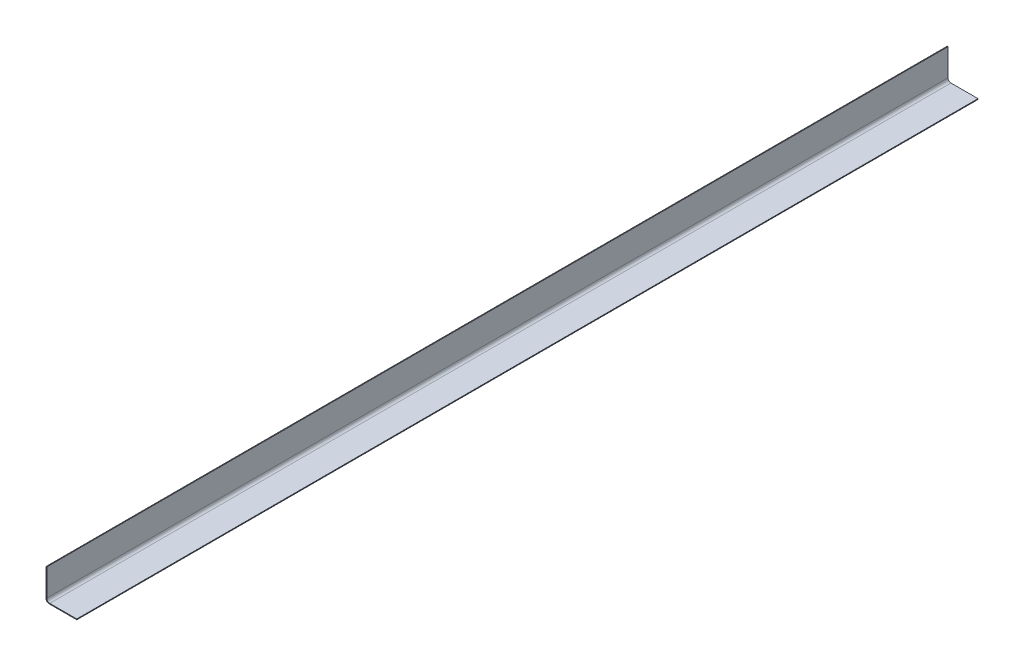
ISO-10303-21;
HEADER;
FILE_DESCRIPTION(('STEP AP214'),'2;1');
FILE_NAME('part.step','',(''),(''),'','','');
FILE_SCHEMA(('AUTOMOTIVE_DESIGN { 1 0 10303 214 1 1 1 1 }'));
ENDSEC;
DATA;
#1=APPLICATION_CONTEXT('core data for automotive mechanical design processes');
#2=APPLICATION_PROTOCOL_DEFINITION('international standard','automotive_design',2000,#1);
#3=PRODUCT_CONTEXT('',#1,'mechanical');
#4=PRODUCT('Part','Part','',(#3));
#5=PRODUCT_RELATED_PRODUCT_CATEGORY('part','',(#4));
#6=PRODUCT_DEFINITION_FORMATION('','',#4);
#7=PRODUCT_DEFINITION_CONTEXT('part definition',#1,'design');
#8=PRODUCT_DEFINITION('design','',#6,#7);
#9=PRODUCT_DEFINITION_SHAPE('','',#8);
#10=(LENGTH_UNIT() NAMED_UNIT(*) SI_UNIT(.MILLI.,.METRE.));
#11=(NAMED_UNIT(*) PLANE_ANGLE_UNIT() SI_UNIT($,.RADIAN.));
#12=(NAMED_UNIT(*) SI_UNIT($,.STERADIAN.) SOLID_ANGLE_UNIT());
#13=UNCERTAINTY_MEASURE_WITH_UNIT(LENGTH_MEASURE(1.E-05),#10,'distance_accuracy_value','');
#14=(GEOMETRIC_REPRESENTATION_CONTEXT(3) GLOBAL_UNCERTAINTY_ASSIGNED_CONTEXT((#13)) GLOBAL_UNIT_ASSIGNED_CONTEXT((#10,
#11,#12)) REPRESENTATION_CONTEXT('',''));
#15=CARTESIAN_POINT('',(0.,0.,0.));
#16=DIRECTION('',(0.,0.,1.));
#17=DIRECTION('',(1.,0.,0.));
#18=AXIS2_PLACEMENT_3D('',#15,#16,#17);
#19=CARTESIAN_POINT('',(40.,0.,1200.));
#20=DIRECTION('',(-1.,0.,0.));
#21=DIRECTION('',(0.,0.,1.));
#22=AXIS2_PLACEMENT_3D('',#19,#20,#21);
#23=PLANE('',#22);
#24=DIRECTION('',(0.,1.,0.));
#25=VECTOR('',#24,1.);
#26=CARTESIAN_POINT('',(40.,0.,0.));
#27=LINE('',#26,#25);
#28=CARTESIAN_POINT('',(40.,-1.,0.));
#29=VERTEX_POINT('',#28);
#30=CARTESIAN_POINT('',(40.,0.,0.));
#31=VERTEX_POINT('',#30);
#32=EDGE_CURVE('E129',#29,#31,#27,.T.);
#33=ORIENTED_EDGE('',*,*,#32,.T.);
#34=DIRECTION('',(0.,0.,-1.));
#35=VECTOR('',#34,1.);
#36=CARTESIAN_POINT('',(40.,0.,1200.));
#37=LINE('',#36,#35);
#38=CARTESIAN_POINT('',(40.,0.,1200.));
#39=VERTEX_POINT('',#38);
#40=EDGE_CURVE('E11',#39,#31,#37,.T.);
#41=ORIENTED_EDGE('',*,*,#40,.F.);
#42=DIRECTION('',(0.,1.,0.));
#43=VECTOR('',#42,1.);
#44=CARTESIAN_POINT('',(40.,0.,1200.));
#45=LINE('',#44,#43);
#46=CARTESIAN_POINT('',(40.,-1.,1200.));
#47=VERTEX_POINT('',#46);
#48=EDGE_CURVE('E143',#47,#39,#45,.T.);
#49=ORIENTED_EDGE('',*,*,#48,.F.);
#50=DIRECTION('',(0.,0.,-1.));
#51=VECTOR('',#50,1.);
#52=CARTESIAN_POINT('',(40.,-1.,1200.));
#53=LINE('',#52,#51);
#54=EDGE_CURVE('E125',#47,#29,#53,.T.);
#55=ORIENTED_EDGE('',*,*,#54,.T.);
#56=EDGE_LOOP('',(#33,#41,#49,#55));
#57=FACE_BOUND('',#56,.T.);
#58=ADVANCED_FACE('F33',(#57),#23,.F.);
#59=CARTESIAN_POINT('',(4.00000000000003,0.,1200.));
#60=DIRECTION('',(0.,-1.,0.));
#61=DIRECTION('',(0.,0.,-1.));
#62=AXIS2_PLACEMENT_3D('',#59,#60,#61);
#63=PLANE('',#62);
#64=DIRECTION('',(-1.,0.,0.));
#65=VECTOR('',#64,1.);
#66=CARTESIAN_POINT('',(4.00000000000003,0.,0.));
#67=LINE('',#66,#65);
#68=CARTESIAN_POINT('',(4.00000000000003,0.,0.));
#69=VERTEX_POINT('',#68);
#70=EDGE_CURVE('E132',#31,#69,#67,.T.);
#71=ORIENTED_EDGE('',*,*,#70,.T.);
#72=DIRECTION('',(0.,0.,-1.));
#73=VECTOR('',#72,1.);
#74=CARTESIAN_POINT('',(4.00000000000003,0.,1200.));
#75=LINE('',#74,#73);
#76=CARTESIAN_POINT('',(4.00000000000003,0.,1200.));
#77=VERTEX_POINT('',#76);
#78=EDGE_CURVE('E41',#77,#69,#75,.T.);
#79=ORIENTED_EDGE('',*,*,#78,.F.);
#80=DIRECTION('',(-1.,0.,0.));
#81=VECTOR('',#80,1.);
#82=CARTESIAN_POINT('',(4.00000000000003,0.,1200.));
#83=LINE('',#82,#81);
#84=EDGE_CURVE('E92',#39,#77,#83,.T.);
#85=ORIENTED_EDGE('',*,*,#84,.F.);
#86=ORIENTED_EDGE('',*,*,#40,.T.);
#87=EDGE_LOOP('',(#71,#79,#85,#86));
#88=FACE_BOUND('',#87,.T.);
#89=ADVANCED_FACE('F178',(#88),#63,.F.);
#90=CARTESIAN_POINT('',(4.,4.,1200.));
#91=DIRECTION('',(0.,0.,-1.));
#92=DIRECTION('',(-1.,0.,0.));
#93=AXIS2_PLACEMENT_3D('',#90,#91,#92);
#94=CYLINDRICAL_SURFACE('',#93,4.);
#95=CARTESIAN_POINT('',(4.,4.,0.));
#96=DIRECTION('',(0.,0.,-1.));
#97=DIRECTION('',(-1.,0.,0.));
#98=AXIS2_PLACEMENT_3D('',#95,#96,#97);
#99=CIRCLE('',#98,4.);
#100=CARTESIAN_POINT('',(0.,4.,0.));
#101=VERTEX_POINT('',#100);
#102=EDGE_CURVE('E134',#69,#101,#99,.T.);
#103=ORIENTED_EDGE('',*,*,#102,.T.);
#104=DIRECTION('',(0.,0.,-1.));
#105=VECTOR('',#104,1.);
#106=CARTESIAN_POINT('',(0.,4.,1200.));
#107=LINE('',#106,#105);
#108=CARTESIAN_POINT('',(0.,4.,1200.));
#109=VERTEX_POINT('',#108);
#110=EDGE_CURVE('E150',#109,#101,#107,.T.);
#111=ORIENTED_EDGE('',*,*,#110,.F.);
#112=CARTESIAN_POINT('',(4.,4.,1200.));
#113=DIRECTION('',(0.,0.,-1.));
#114=DIRECTION('',(-1.,0.,0.));
#115=AXIS2_PLACEMENT_3D('',#112,#113,#114);
#116=CIRCLE('',#115,4.);
#117=EDGE_CURVE('E158',#77,#109,#116,.T.);
#118=ORIENTED_EDGE('',*,*,#117,.F.);
#119=ORIENTED_EDGE('',*,*,#78,.T.);
#120=EDGE_LOOP('',(#103,#111,#118,#119));
#121=FACE_BOUND('',#120,.T.);
#122=ADVANCED_FACE('F156',(#121),#94,.F.);
#123=CARTESIAN_POINT('',(0.,40.,1200.));
#124=DIRECTION('',(-1.,0.,0.));
#125=DIRECTION('',(0.,0.,1.));
#126=AXIS2_PLACEMENT_3D('',#123,#124,#125);
#127=PLANE('',#126);
#128=DIRECTION('',(0.,1.,0.));
#129=VECTOR('',#128,1.);
#130=CARTESIAN_POINT('',(0.,40.,0.));
#131=LINE('',#130,#129);
#132=CARTESIAN_POINT('',(0.,40.,0.));
#133=VERTEX_POINT('',#132);
#134=EDGE_CURVE('E136',#101,#133,#131,.T.);
#135=ORIENTED_EDGE('',*,*,#134,.T.);
#136=DIRECTION('',(0.,0.,-1.));
#137=VECTOR('',#136,1.);
#138=CARTESIAN_POINT('',(0.,40.,1200.));
#139=LINE('',#138,#137);
#140=CARTESIAN_POINT('',(0.,40.,1200.));
#141=VERTEX_POINT('',#140);
#142=EDGE_CURVE('E147',#141,#133,#139,.T.);
#143=ORIENTED_EDGE('',*,*,#142,.F.);
#144=DIRECTION('',(0.,1.,0.));
#145=VECTOR('',#144,1.);
#146=CARTESIAN_POINT('',(0.,40.,1200.));
#147=LINE('',#146,#145);
#148=EDGE_CURVE('E170',#109,#141,#147,.T.);
#149=ORIENTED_EDGE('',*,*,#148,.F.);
#150=ORIENTED_EDGE('',*,*,#110,.T.);
#151=EDGE_LOOP('',(#135,#143,#149,#150));
#152=FACE_BOUND('',#151,.T.);
#153=ADVANCED_FACE('F166',(#152),#127,.F.);
#154=CARTESIAN_POINT('',(-0.999999999999999,40.,1200.));
#155=DIRECTION('',(0.,-1.,0.));
#156=DIRECTION('',(1.,0.,0.));
#157=AXIS2_PLACEMENT_3D('',#154,#155,#156);
#158=PLANE('',#157);
#159=DIRECTION('',(-1.,0.,0.));
#160=VECTOR('',#159,1.);
#161=CARTESIAN_POINT('',(-0.999999999999999,40.,0.));
#162=LINE('',#161,#160);
#163=CARTESIAN_POINT('',(-0.999999999999999,40.,0.));
#164=VERTEX_POINT('',#163);
#165=EDGE_CURVE('E138',#133,#164,#162,.T.);
#166=ORIENTED_EDGE('',*,*,#165,.T.);
#167=DIRECTION('',(0.,0.,-1.));
#168=VECTOR('',#167,1.);
#169=CARTESIAN_POINT('',(-0.999999999999999,40.,1200.));
#170=LINE('',#169,#168);
#171=CARTESIAN_POINT('',(-0.999999999999999,40.,1200.));
#172=VERTEX_POINT('',#171);
#173=EDGE_CURVE('E120',#172,#164,#170,.T.);
#174=ORIENTED_EDGE('',*,*,#173,.F.);
#175=DIRECTION('',(-1.,0.,0.));
#176=VECTOR('',#175,1.);
#177=CARTESIAN_POINT('',(-0.999999999999999,40.,1200.));
#178=LINE('',#177,#176);
#179=EDGE_CURVE('E111',#141,#172,#178,.T.);
#180=ORIENTED_EDGE('',*,*,#179,.F.);
#181=ORIENTED_EDGE('',*,*,#142,.T.);
#182=EDGE_LOOP('',(#166,#174,#180,#181));
#183=FACE_BOUND('',#182,.T.);
#184=ADVANCED_FACE('F169',(#183),#158,.F.);
#185=CARTESIAN_POINT('',(-1.,3.00000000000002,1200.));
#186=DIRECTION('',(1.,0.,0.));
#187=DIRECTION('',(0.,1.,0.));
#188=AXIS2_PLACEMENT_3D('',#185,#186,#187);
#189=PLANE('',#188);
#190=DIRECTION('',(0.,-1.,0.));
#191=VECTOR('',#190,1.);
#192=CARTESIAN_POINT('',(-1.,3.00000000000002,0.));
#193=LINE('',#192,#191);
#194=CARTESIAN_POINT('',(-1.,3.00000000000002,0.));
#195=VERTEX_POINT('',#194);
#196=EDGE_CURVE('E119',#164,#195,#193,.T.);
#197=ORIENTED_EDGE('',*,*,#196,.T.);
#198=DIRECTION('',(0.,0.,-1.));
#199=VECTOR('',#198,1.);
#200=CARTESIAN_POINT('',(-1.,3.00000000000002,1200.));
#201=LINE('',#200,#199);
#202=CARTESIAN_POINT('',(-1.,3.00000000000002,1200.));
#203=VERTEX_POINT('',#202);
#204=EDGE_CURVE('E116',#203,#195,#201,.T.);
#205=ORIENTED_EDGE('',*,*,#204,.F.);
#206=DIRECTION('',(0.,-1.,0.));
#207=VECTOR('',#206,1.);
#208=CARTESIAN_POINT('',(-1.,3.00000000000002,1200.));
#209=LINE('',#208,#207);
#210=EDGE_CURVE('E105',#172,#203,#209,.T.);
#211=ORIENTED_EDGE('',*,*,#210,.F.);
#212=ORIENTED_EDGE('',*,*,#173,.T.);
#213=EDGE_LOOP('',(#197,#205,#211,#212));
#214=FACE_BOUND('',#213,.T.);
#215=ADVANCED_FACE('F117',(#214),#189,.F.);
#216=CARTESIAN_POINT('',(3.,2.99999999999999,1200.));
#217=DIRECTION('',(0.,0.,-1.));
#218=DIRECTION('',(-1.,0.,0.));
#219=AXIS2_PLACEMENT_3D('',#216,#217,#218);
#220=CYLINDRICAL_SURFACE('',#219,4.);
#221=CARTESIAN_POINT('',(3.,2.99999999999999,0.));
#222=DIRECTION('',(0.,0.,1.));
#223=DIRECTION('',(1.,0.,0.));
#224=AXIS2_PLACEMENT_3D('',#221,#222,#223);
#225=CIRCLE('',#224,4.);
#226=CARTESIAN_POINT('',(3.00000000000003,-1.,0.));
#227=VERTEX_POINT('',#226);
#228=EDGE_CURVE('E78',#195,#227,#225,.T.);
#229=ORIENTED_EDGE('',*,*,#228,.T.);
#230=DIRECTION('',(0.,0.,-1.));
#231=VECTOR('',#230,1.);
#232=CARTESIAN_POINT('',(3.00000000000003,-1.,1200.));
#233=LINE('',#232,#231);
#234=CARTESIAN_POINT('',(3.00000000000003,-1.,1200.));
#235=VERTEX_POINT('',#234);
#236=EDGE_CURVE('E121',#235,#227,#233,.T.);
#237=ORIENTED_EDGE('',*,*,#236,.F.);
#238=CARTESIAN_POINT('',(3.,2.99999999999999,1200.));
#239=DIRECTION('',(0.,0.,1.));
#240=DIRECTION('',(1.,0.,0.));
#241=AXIS2_PLACEMENT_3D('',#238,#239,#240);
#242=CIRCLE('',#241,4.);
#243=EDGE_CURVE('E109',#203,#235,#242,.T.);
#244=ORIENTED_EDGE('',*,*,#243,.F.);
#245=ORIENTED_EDGE('',*,*,#204,.T.);
#246=EDGE_LOOP('',(#229,#237,#244,#245));
#247=FACE_BOUND('',#246,.T.);
#248=ADVANCED_FACE('F123',(#247),#220,.T.);
#249=CARTESIAN_POINT('',(40.,-1.,1200.));
#250=DIRECTION('',(0.,1.,0.));
#251=DIRECTION('',(-1.,0.,0.));
#252=AXIS2_PLACEMENT_3D('',#249,#250,#251);
#253=PLANE('',#252);
#254=DIRECTION('',(1.,0.,0.));
#255=VECTOR('',#254,1.);
#256=CARTESIAN_POINT('',(40.,-1.,0.));
#257=LINE('',#256,#255);
#258=EDGE_CURVE('E84',#227,#29,#257,.T.);
#259=ORIENTED_EDGE('',*,*,#258,.T.);
#260=ORIENTED_EDGE('',*,*,#54,.F.);
#261=DIRECTION('',(1.,0.,0.));
#262=VECTOR('',#261,1.);
#263=CARTESIAN_POINT('',(40.,-1.,1200.));
#264=LINE('',#263,#262);
#265=EDGE_CURVE('E49',#235,#47,#264,.T.);
#266=ORIENTED_EDGE('',*,*,#265,.F.);
#267=ORIENTED_EDGE('',*,*,#236,.T.);
#268=EDGE_LOOP('',(#259,#260,#266,#267));
#269=FACE_BOUND('',#268,.T.);
#270=ADVANCED_FACE('F194',(#269),#253,.F.);
#271=CARTESIAN_POINT('',(3.,2.99999999999999,1200.));
#272=DIRECTION('',(0.,0.,1.));
#273=DIRECTION('',(1.,0.,0.));
#274=AXIS2_PLACEMENT_3D('',#271,#272,#273);
#275=PLANE('',#274);
#276=ORIENTED_EDGE('',*,*,#48,.T.);
#277=ORIENTED_EDGE('',*,*,#84,.T.);
#278=ORIENTED_EDGE('',*,*,#117,.T.);
#279=ORIENTED_EDGE('',*,*,#148,.T.);
#280=ORIENTED_EDGE('',*,*,#179,.T.);
#281=ORIENTED_EDGE('',*,*,#210,.T.);
#282=ORIENTED_EDGE('',*,*,#243,.T.);
#283=ORIENTED_EDGE('',*,*,#265,.T.);
#284=EDGE_LOOP('',(#276,#277,#278,#279,#280,#281,#282,#283));
#285=FACE_BOUND('',#284,.T.);
#286=ADVANCED_FACE('F107',(#285),#275,.T.);
#287=CARTESIAN_POINT('',(3.,2.99999999999999,0.));
#288=DIRECTION('',(0.,0.,1.));
#289=DIRECTION('',(1.,0.,0.));
#290=AXIS2_PLACEMENT_3D('',#287,#288,#289);
#291=PLANE('',#290);
#292=ORIENTED_EDGE('',*,*,#32,.F.);
#293=ORIENTED_EDGE('',*,*,#258,.F.);
#294=ORIENTED_EDGE('',*,*,#228,.F.);
#295=ORIENTED_EDGE('',*,*,#196,.F.);
#296=ORIENTED_EDGE('',*,*,#165,.F.);
#297=ORIENTED_EDGE('',*,*,#134,.F.);
#298=ORIENTED_EDGE('',*,*,#102,.F.);
#299=ORIENTED_EDGE('',*,*,#70,.F.);
#300=EDGE_LOOP('',(#292,#293,#294,#295,#296,#297,#298,#299));
#301=FACE_BOUND('',#300,.T.);
#302=ADVANCED_FACE('F162',(#301),#291,.F.);
#303=CLOSED_SHELL('',(#58,#89,#122,#153,#184,#215,#248,#270,#286,#302));
#304=MANIFOLD_SOLID_BREP('B2',#303);
#305=ADVANCED_BREP_SHAPE_REPRESENTATION('',(#18,#304),#14);
#306=SHAPE_DEFINITION_REPRESENTATION(#9,#305);
ENDSEC;
END-ISO-10303-21;
